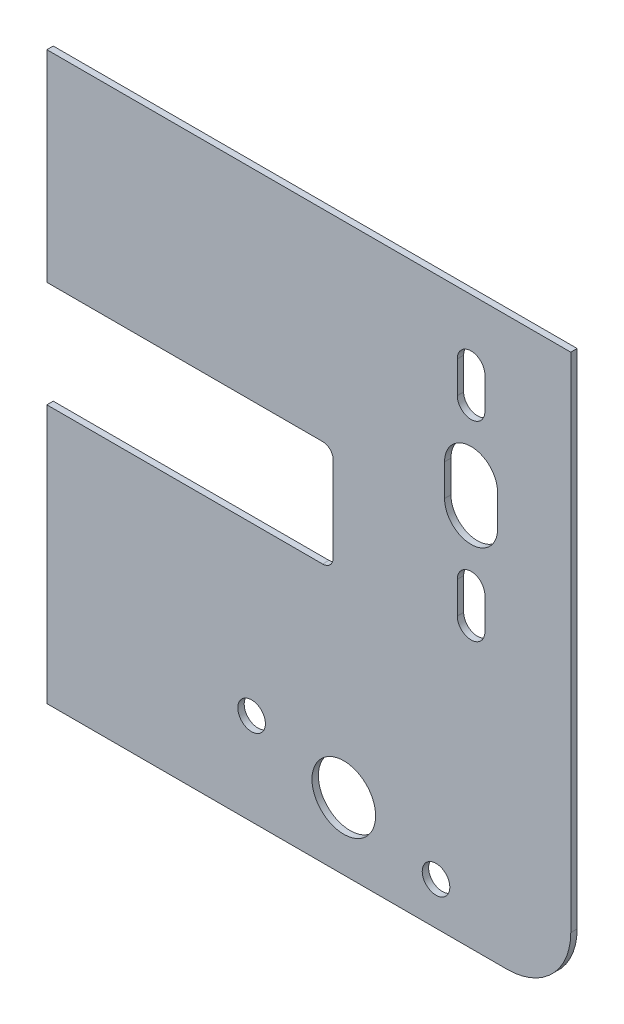
ISO-10303-21;
HEADER;
FILE_DESCRIPTION(('STEP AP214'),'2;1');
FILE_NAME('part.step','',(''),(''),'','','');
FILE_SCHEMA(('AUTOMOTIVE_DESIGN { 1 0 10303 214 1 1 1 1 }'));
ENDSEC;
DATA;
#1=APPLICATION_CONTEXT('core data for automotive mechanical design processes');
#2=APPLICATION_PROTOCOL_DEFINITION('international standard','automotive_design',2000,#1);
#3=PRODUCT_CONTEXT('',#1,'mechanical');
#4=PRODUCT('Part','Part','',(#3));
#5=PRODUCT_RELATED_PRODUCT_CATEGORY('part','',(#4));
#6=PRODUCT_DEFINITION_FORMATION('','',#4);
#7=PRODUCT_DEFINITION_CONTEXT('part definition',#1,'design');
#8=PRODUCT_DEFINITION('design','',#6,#7);
#9=PRODUCT_DEFINITION_SHAPE('','',#8);
#10=(LENGTH_UNIT() NAMED_UNIT(*) SI_UNIT(.MILLI.,.METRE.));
#11=(NAMED_UNIT(*) PLANE_ANGLE_UNIT() SI_UNIT($,.RADIAN.));
#12=(NAMED_UNIT(*) SI_UNIT($,.STERADIAN.) SOLID_ANGLE_UNIT());
#13=UNCERTAINTY_MEASURE_WITH_UNIT(LENGTH_MEASURE(1.E-05),#10,'distance_accuracy_value','');
#14=(GEOMETRIC_REPRESENTATION_CONTEXT(3) GLOBAL_UNCERTAINTY_ASSIGNED_CONTEXT((#13)) GLOBAL_UNIT_ASSIGNED_CONTEXT((#10,
#11,#12)) REPRESENTATION_CONTEXT('',''));
#15=CARTESIAN_POINT('',(0.,0.,0.));
#16=DIRECTION('',(0.,0.,1.));
#17=DIRECTION('',(1.,0.,0.));
#18=AXIS2_PLACEMENT_3D('',#15,#16,#17);
#19=CARTESIAN_POINT('',(-123.5,-133.5,3.));
#20=DIRECTION('',(1.,0.,0.));
#21=DIRECTION('',(0.,0.,-1.));
#22=AXIS2_PLACEMENT_3D('',#19,#20,#21);
#23=PLANE('',#22);
#24=DIRECTION('',(0.,-1.,0.));
#25=VECTOR('',#24,1.);
#26=CARTESIAN_POINT('',(-123.5,-133.5,3.));
#27=LINE('',#26,#25);
#28=CARTESIAN_POINT('',(-123.5,-11.4999999999914,3.));
#29=VERTEX_POINT('',#28);
#30=CARTESIAN_POINT('',(-123.5,-133.5,3.));
#31=VERTEX_POINT('',#30);
#32=EDGE_CURVE('E327',#29,#31,#27,.T.);
#33=ORIENTED_EDGE('',*,*,#32,.F.);
#34=DIRECTION('',(0.,0.,-1.));
#35=VECTOR('',#34,1.);
#36=CARTESIAN_POINT('',(-123.5,-11.4999999999914,3.));
#37=LINE('',#36,#35);
#38=CARTESIAN_POINT('',(-123.5,-11.4999999999914,0.));
#39=VERTEX_POINT('',#38);
#40=EDGE_CURVE('E355',#29,#39,#37,.T.);
#41=ORIENTED_EDGE('',*,*,#40,.T.);
#42=DIRECTION('',(0.,-1.,0.));
#43=VECTOR('',#42,1.);
#44=CARTESIAN_POINT('',(-123.5,-133.5,0.));
#45=LINE('',#44,#43);
#46=CARTESIAN_POINT('',(-123.5,-133.5,0.));
#47=VERTEX_POINT('',#46);
#48=EDGE_CURVE('E338',#39,#47,#45,.T.);
#49=ORIENTED_EDGE('',*,*,#48,.T.);
#50=DIRECTION('',(0.,0.,-1.));
#51=VECTOR('',#50,1.);
#52=CARTESIAN_POINT('',(-123.5,-133.5,3.));
#53=LINE('',#52,#51);
#54=EDGE_CURVE('E334',#31,#47,#53,.T.);
#55=ORIENTED_EDGE('',*,*,#54,.F.);
#56=EDGE_LOOP('',(#33,#41,#49,#55));
#57=FACE_BOUND('',#56,.T.);
#58=ADVANCED_FACE('F33',(#57),#23,.F.);
#59=CARTESIAN_POINT('',(0.,0.,3.));
#60=DIRECTION('',(0.,0.,-1.));
#61=DIRECTION('',(-1.,0.,0.));
#62=AXIS2_PLACEMENT_3D('',#59,#60,#61);
#63=PLANE('',#62);
#64=CARTESIAN_POINT('',(59.9666621830082,-113.5,3.));
#65=DIRECTION('',(0.,0.,-1.));
#66=DIRECTION('',(-1.,0.,0.));
#67=AXIS2_PLACEMENT_3D('',#64,#65,#66);
#68=CIRCLE('',#67,6.50000000000002);
#69=CARTESIAN_POINT('',(53.4666621830082,-113.5,3.));
#70=VERTEX_POINT('',#69);
#71=EDGE_CURVE('E304',#70,#70,#68,.T.);
#72=ORIENTED_EDGE('',*,*,#71,.T.);
#73=EDGE_LOOP('',(#72));
#74=FACE_BOUND('',#73,.T.);
#75=CARTESIAN_POINT('',(16.5000000000001,-101.853142970387,3.));
#76=DIRECTION('',(0.,0.,-1.));
#77=DIRECTION('',(-1.,0.,0.));
#78=AXIS2_PLACEMENT_3D('',#75,#76,#77);
#79=CIRCLE('',#78,15.);
#80=CARTESIAN_POINT('',(1.50000000000009,-101.853142970387,3.));
#81=VERTEX_POINT('',#80);
#82=EDGE_CURVE('E311',#81,#81,#79,.T.);
#83=ORIENTED_EDGE('',*,*,#82,.T.);
#84=EDGE_LOOP('',(#83));
#85=FACE_BOUND('',#84,.T.);
#86=CARTESIAN_POINT('',(-26.9666621830081,-90.2062859407737,3.));
#87=DIRECTION('',(0.,0.,-1.));
#88=DIRECTION('',(-1.,0.,0.));
#89=AXIS2_PLACEMENT_3D('',#86,#87,#88);
#90=CIRCLE('',#89,6.50000000000003);
#91=CARTESIAN_POINT('',(-33.4666621830081,-90.2062859407737,3.));
#92=VERTEX_POINT('',#91);
#93=EDGE_CURVE('E317',#92,#92,#90,.T.);
#94=ORIENTED_EDGE('',*,*,#93,.T.);
#95=EDGE_LOOP('',(#94));
#96=FACE_BOUND('',#95,.T.);
#97=DIRECTION('',(1.,0.,0.));
#98=VECTOR('',#97,1.);
#99=CARTESIAN_POINT('',(-123.5,-133.5,3.));
#100=LINE('',#99,#98);
#101=CARTESIAN_POINT('',(93.5000000000001,-133.5,3.));
#102=VERTEX_POINT('',#101);
#103=EDGE_CURVE('E331',#31,#102,#100,.T.);
#104=ORIENTED_EDGE('',*,*,#103,.T.);
#105=CARTESIAN_POINT('',(93.5000000000001,-103.5,3.));
#106=DIRECTION('',(0.,0.,-1.));
#107=DIRECTION('',(-1.,0.,0.));
#108=AXIS2_PLACEMENT_3D('',#105,#106,#107);
#109=CIRCLE('',#108,30.);
#110=CARTESIAN_POINT('',(123.5,-103.5,3.));
#111=VERTEX_POINT('',#110);
#112=EDGE_CURVE('E11',#102,#111,#109,.F.);
#113=ORIENTED_EDGE('',*,*,#112,.T.);
#114=DIRECTION('',(0.,1.,0.));
#115=VECTOR('',#114,1.);
#116=CARTESIAN_POINT('',(123.5,-133.5,3.));
#117=LINE('',#116,#115);
#118=CARTESIAN_POINT('',(123.5,133.5,3.));
#119=VERTEX_POINT('',#118);
#120=EDGE_CURVE('E322',#111,#119,#117,.T.);
#121=ORIENTED_EDGE('',*,*,#120,.T.);
#122=DIRECTION('',(-1.,0.,0.));
#123=VECTOR('',#122,1.);
#124=CARTESIAN_POINT('',(-123.5,133.5,3.));
#125=LINE('',#124,#123);
#126=CARTESIAN_POINT('',(-123.5,133.5,3.));
#127=VERTEX_POINT('',#126);
#128=EDGE_CURVE('E324',#119,#127,#125,.T.);
#129=ORIENTED_EDGE('',*,*,#128,.T.);
#130=CARTESIAN_POINT('',(-123.5,38.5000000000086,3.));
#131=VERTEX_POINT('',#130);
#132=EDGE_CURVE('E328',#127,#131,#27,.T.);
#133=ORIENTED_EDGE('',*,*,#132,.T.);
#134=DIRECTION('',(1.,0.,0.));
#135=VECTOR('',#134,1.);
#136=CARTESIAN_POINT('',(0.,38.5000000000085,3.));
#137=LINE('',#136,#135);
#138=CARTESIAN_POINT('',(6.50000000000007,38.5000000000085,3.));
#139=VERTEX_POINT('',#138);
#140=EDGE_CURVE('E295',#131,#139,#137,.T.);
#141=ORIENTED_EDGE('',*,*,#140,.T.);
#142=CARTESIAN_POINT('',(6.50000000000007,33.5000000000085,3.));
#143=DIRECTION('',(0.,0.,-1.));
#144=DIRECTION('',(-1.,0.,0.));
#145=AXIS2_PLACEMENT_3D('',#142,#143,#144);
#146=CIRCLE('',#145,5.);
#147=CARTESIAN_POINT('',(11.5000000000001,33.5000000000085,3.));
#148=VERTEX_POINT('',#147);
#149=EDGE_CURVE('E374',#139,#148,#146,.T.);
#150=ORIENTED_EDGE('',*,*,#149,.T.);
#151=DIRECTION('',(0.,-1.,0.));
#152=VECTOR('',#151,1.);
#153=CARTESIAN_POINT('',(11.5000000000001,0.,3.));
#154=LINE('',#153,#152);
#155=CARTESIAN_POINT('',(11.5000000000001,-6.49999999999145,3.));
#156=VERTEX_POINT('',#155);
#157=EDGE_CURVE('E300',#148,#156,#154,.T.);
#158=ORIENTED_EDGE('',*,*,#157,.T.);
#159=CARTESIAN_POINT('',(6.50000000000006,-6.49999999999145,3.));
#160=DIRECTION('',(0.,0.,-1.));
#161=DIRECTION('',(-1.,0.,0.));
#162=AXIS2_PLACEMENT_3D('',#159,#160,#161);
#163=CIRCLE('',#162,5.);
#164=CARTESIAN_POINT('',(6.50000000000006,-11.4999999999915,3.));
#165=VERTEX_POINT('',#164);
#166=EDGE_CURVE('E370',#156,#165,#163,.T.);
#167=ORIENTED_EDGE('',*,*,#166,.T.);
#168=DIRECTION('',(-1.,0.,0.));
#169=VECTOR('',#168,1.);
#170=CARTESIAN_POINT('',(0.,-11.4999999999915,3.));
#171=LINE('',#170,#169);
#172=EDGE_CURVE('E298',#165,#29,#171,.T.);
#173=ORIENTED_EDGE('',*,*,#172,.T.);
#174=ORIENTED_EDGE('',*,*,#32,.T.);
#175=EDGE_LOOP('',(#104,#113,#121,#129,#133,#141,#150,#158,#167,#173,#174));
#176=FACE_BOUND('',#175,.T.);
#177=DIRECTION('',(0.,-1.,0.));
#178=VECTOR('',#177,1.);
#179=CARTESIAN_POINT('',(89.0000000000001,0.,3.));
#180=LINE('',#179,#178);
#181=CARTESIAN_POINT('',(89.0000000000001,59.,3.));
#182=VERTEX_POINT('',#181);
#183=CARTESIAN_POINT('',(89.0000000000001,44.,3.));
#184=VERTEX_POINT('',#183);
#185=EDGE_CURVE('E271',#182,#184,#180,.T.);
#186=ORIENTED_EDGE('',*,*,#185,.T.);
#187=CARTESIAN_POINT('',(76.5000000000001,44.,3.));
#188=DIRECTION('',(0.,0.,-1.));
#189=DIRECTION('',(-1.,0.,0.));
#190=AXIS2_PLACEMENT_3D('',#187,#188,#189);
#191=CIRCLE('',#190,12.5);
#192=CARTESIAN_POINT('',(64.0000000000001,44.,3.));
#193=VERTEX_POINT('',#192);
#194=EDGE_CURVE('E276',#184,#193,#191,.T.);
#195=ORIENTED_EDGE('',*,*,#194,.T.);
#196=DIRECTION('',(0.,1.,0.));
#197=VECTOR('',#196,1.);
#198=CARTESIAN_POINT('',(64.0000000000001,0.,3.));
#199=LINE('',#198,#197);
#200=CARTESIAN_POINT('',(64.0000000000001,59.,3.));
#201=VERTEX_POINT('',#200);
#202=EDGE_CURVE('E269',#193,#201,#199,.T.);
#203=ORIENTED_EDGE('',*,*,#202,.T.);
#204=CARTESIAN_POINT('',(76.5000000000001,59.,3.));
#205=DIRECTION('',(0.,0.,-1.));
#206=DIRECTION('',(-1.,0.,0.));
#207=AXIS2_PLACEMENT_3D('',#204,#205,#206);
#208=CIRCLE('',#207,12.5);
#209=EDGE_CURVE('E273',#201,#182,#208,.T.);
#210=ORIENTED_EDGE('',*,*,#209,.T.);
#211=EDGE_LOOP('',(#186,#195,#203,#210));
#212=FACE_BOUND('',#211,.T.);
#213=DIRECTION('',(0.,-1.,0.));
#214=VECTOR('',#213,1.);
#215=CARTESIAN_POINT('',(83.0000000000001,0.,3.));
#216=LINE('',#215,#214);
#217=CARTESIAN_POINT('',(83.0000000000001,104.,3.));
#218=VERTEX_POINT('',#217);
#219=CARTESIAN_POINT('',(83.0000000000001,89.,3.));
#220=VERTEX_POINT('',#219);
#221=EDGE_CURVE('E267',#218,#220,#216,.T.);
#222=ORIENTED_EDGE('',*,*,#221,.T.);
#223=CARTESIAN_POINT('',(76.5000000000001,89.,3.));
#224=DIRECTION('',(0.,0.,-1.));
#225=DIRECTION('',(-1.,0.,0.));
#226=AXIS2_PLACEMENT_3D('',#223,#224,#225);
#227=CIRCLE('',#226,6.50000000000001);
#228=CARTESIAN_POINT('',(70.0000000000001,89.,3.));
#229=VERTEX_POINT('',#228);
#230=EDGE_CURVE('E285',#220,#229,#227,.T.);
#231=ORIENTED_EDGE('',*,*,#230,.T.);
#232=DIRECTION('',(0.,1.,0.));
#233=VECTOR('',#232,1.);
#234=CARTESIAN_POINT('',(70.0000000000001,0.,3.));
#235=LINE('',#234,#233);
#236=CARTESIAN_POINT('',(70.0000000000001,104.,3.));
#237=VERTEX_POINT('',#236);
#238=EDGE_CURVE('E48',#229,#237,#235,.T.);
#239=ORIENTED_EDGE('',*,*,#238,.T.);
#240=CARTESIAN_POINT('',(76.5000000000001,104.,3.));
#241=DIRECTION('',(0.,0.,-1.));
#242=DIRECTION('',(-1.,0.,0.));
#243=AXIS2_PLACEMENT_3D('',#240,#241,#242);
#244=CIRCLE('',#243,6.50000000000001);
#245=EDGE_CURVE('E283',#237,#218,#244,.T.);
#246=ORIENTED_EDGE('',*,*,#245,.T.);
#247=EDGE_LOOP('',(#222,#231,#239,#246));
#248=FACE_BOUND('',#247,.T.);
#249=DIRECTION('',(0.,-1.,0.));
#250=VECTOR('',#249,1.);
#251=CARTESIAN_POINT('',(83.0000000000001,0.,3.));
#252=LINE('',#251,#250);
#253=CARTESIAN_POINT('',(83.0000000000001,14.,3.));
#254=VERTEX_POINT('',#253);
#255=CARTESIAN_POINT('',(83.0000000000001,-0.999999999999966,3.));
#256=VERTEX_POINT('',#255);
#257=EDGE_CURVE('E264',#254,#256,#252,.T.);
#258=ORIENTED_EDGE('',*,*,#257,.T.);
#259=CARTESIAN_POINT('',(76.5000000000001,-0.999999999999966,3.));
#260=DIRECTION('',(0.,0.,-1.));
#261=DIRECTION('',(-1.,0.,0.));
#262=AXIS2_PLACEMENT_3D('',#259,#260,#261);
#263=CIRCLE('',#262,6.50000000000001);
#264=CARTESIAN_POINT('',(70.0000000000001,-0.999999999999966,3.));
#265=VERTEX_POINT('',#264);
#266=EDGE_CURVE('E281',#256,#265,#263,.T.);
#267=ORIENTED_EDGE('',*,*,#266,.T.);
#268=DIRECTION('',(0.,1.,0.));
#269=VECTOR('',#268,1.);
#270=CARTESIAN_POINT('',(70.0000000000001,0.,3.));
#271=LINE('',#270,#269);
#272=CARTESIAN_POINT('',(70.0000000000001,14.,3.));
#273=VERTEX_POINT('',#272);
#274=EDGE_CURVE('E56',#265,#273,#271,.T.);
#275=ORIENTED_EDGE('',*,*,#274,.T.);
#276=CARTESIAN_POINT('',(76.5000000000001,14.,3.));
#277=DIRECTION('',(0.,0.,-1.));
#278=DIRECTION('',(-1.,0.,0.));
#279=AXIS2_PLACEMENT_3D('',#276,#277,#278);
#280=CIRCLE('',#279,6.50000000000001);
#281=EDGE_CURVE('E279',#273,#254,#280,.T.);
#282=ORIENTED_EDGE('',*,*,#281,.T.);
#283=EDGE_LOOP('',(#258,#267,#275,#282));
#284=FACE_BOUND('',#283,.T.);
#285=ADVANCED_FACE('F388',(#74,#85,#96,#176,#212,#248,#284),#63,.F.);
#286=CARTESIAN_POINT('',(0.,0.,0.));
#287=DIRECTION('',(0.,0.,-1.));
#288=DIRECTION('',(-1.,0.,0.));
#289=AXIS2_PLACEMENT_3D('',#286,#287,#288);
#290=PLANE('',#289);
#291=CARTESIAN_POINT('',(76.5000000000001,89.,0.));
#292=DIRECTION('',(0.,0.,-1.));
#293=DIRECTION('',(-1.,0.,0.));
#294=AXIS2_PLACEMENT_3D('',#291,#292,#293);
#295=CIRCLE('',#294,6.50000000000001);
#296=CARTESIAN_POINT('',(83.0000000000001,89.,0.));
#297=VERTEX_POINT('',#296);
#298=CARTESIAN_POINT('',(70.0000000000001,89.,0.));
#299=VERTEX_POINT('',#298);
#300=EDGE_CURVE('E196',#297,#299,#295,.T.);
#301=ORIENTED_EDGE('',*,*,#300,.F.);
#302=DIRECTION('',(0.,-1.,0.));
#303=VECTOR('',#302,1.);
#304=CARTESIAN_POINT('',(83.0000000000001,89.,0.));
#305=LINE('',#304,#303);
#306=CARTESIAN_POINT('',(83.0000000000001,104.,0.));
#307=VERTEX_POINT('',#306);
#308=EDGE_CURVE('E207',#307,#297,#305,.T.);
#309=ORIENTED_EDGE('',*,*,#308,.F.);
#310=CARTESIAN_POINT('',(76.5000000000001,104.,0.));
#311=DIRECTION('',(0.,0.,-1.));
#312=DIRECTION('',(-1.,0.,0.));
#313=AXIS2_PLACEMENT_3D('',#310,#311,#312);
#314=CIRCLE('',#313,6.50000000000001);
#315=CARTESIAN_POINT('',(70.0000000000001,104.,0.));
#316=VERTEX_POINT('',#315);
#317=EDGE_CURVE('E198',#316,#307,#314,.T.);
#318=ORIENTED_EDGE('',*,*,#317,.F.);
#319=DIRECTION('',(0.,1.,0.));
#320=VECTOR('',#319,1.);
#321=CARTESIAN_POINT('',(70.0000000000001,89.,0.));
#322=LINE('',#321,#320);
#323=EDGE_CURVE('E190',#299,#316,#322,.T.);
#324=ORIENTED_EDGE('',*,*,#323,.F.);
#325=EDGE_LOOP('',(#301,#309,#318,#324));
#326=FACE_BOUND('',#325,.T.);
#327=CARTESIAN_POINT('',(76.5000000000001,-0.999999999999966,0.));
#328=DIRECTION('',(0.,0.,-1.));
#329=DIRECTION('',(-1.,0.,0.));
#330=AXIS2_PLACEMENT_3D('',#327,#328,#329);
#331=CIRCLE('',#330,6.50000000000001);
#332=CARTESIAN_POINT('',(83.0000000000001,-0.999999999999966,0.));
#333=VERTEX_POINT('',#332);
#334=CARTESIAN_POINT('',(70.0000000000001,-0.999999999999966,0.));
#335=VERTEX_POINT('',#334);
#336=EDGE_CURVE('E225',#333,#335,#331,.T.);
#337=ORIENTED_EDGE('',*,*,#336,.F.);
#338=DIRECTION('',(0.,-1.,0.));
#339=VECTOR('',#338,1.);
#340=CARTESIAN_POINT('',(83.0000000000001,-0.999999999999966,0.));
#341=LINE('',#340,#339);
#342=CARTESIAN_POINT('',(83.0000000000001,14.,0.));
#343=VERTEX_POINT('',#342);
#344=EDGE_CURVE('E235',#343,#333,#341,.T.);
#345=ORIENTED_EDGE('',*,*,#344,.F.);
#346=CARTESIAN_POINT('',(76.5000000000001,14.,0.));
#347=DIRECTION('',(0.,0.,-1.));
#348=DIRECTION('',(-1.,0.,0.));
#349=AXIS2_PLACEMENT_3D('',#346,#347,#348);
#350=CIRCLE('',#349,6.50000000000001);
#351=CARTESIAN_POINT('',(70.0000000000001,14.,0.));
#352=VERTEX_POINT('',#351);
#353=EDGE_CURVE('E232',#352,#343,#350,.T.);
#354=ORIENTED_EDGE('',*,*,#353,.F.);
#355=DIRECTION('',(0.,1.,0.));
#356=VECTOR('',#355,1.);
#357=CARTESIAN_POINT('',(70.0000000000001,-0.999999999999966,0.));
#358=LINE('',#357,#356);
#359=EDGE_CURVE('E228',#335,#352,#358,.T.);
#360=ORIENTED_EDGE('',*,*,#359,.F.);
#361=EDGE_LOOP('',(#337,#345,#354,#360));
#362=FACE_BOUND('',#361,.T.);
#363=CARTESIAN_POINT('',(76.5000000000001,44.,0.));
#364=DIRECTION('',(0.,0.,-1.));
#365=DIRECTION('',(-1.,0.,0.));
#366=AXIS2_PLACEMENT_3D('',#363,#364,#365);
#367=CIRCLE('',#366,12.5);
#368=CARTESIAN_POINT('',(89.0000000000001,44.,0.));
#369=VERTEX_POINT('',#368);
#370=CARTESIAN_POINT('',(64.0000000000001,44.,0.));
#371=VERTEX_POINT('',#370);
#372=EDGE_CURVE('E243',#369,#371,#367,.T.);
#373=ORIENTED_EDGE('',*,*,#372,.F.);
#374=DIRECTION('',(0.,-1.,0.));
#375=VECTOR('',#374,1.);
#376=CARTESIAN_POINT('',(89.0000000000001,44.,0.));
#377=LINE('',#376,#375);
#378=CARTESIAN_POINT('',(89.0000000000001,59.,0.));
#379=VERTEX_POINT('',#378);
#380=EDGE_CURVE('E252',#379,#369,#377,.T.);
#381=ORIENTED_EDGE('',*,*,#380,.F.);
#382=CARTESIAN_POINT('',(76.5000000000001,59.,0.));
#383=DIRECTION('',(0.,0.,-1.));
#384=DIRECTION('',(-1.,0.,0.));
#385=AXIS2_PLACEMENT_3D('',#382,#383,#384);
#386=CIRCLE('',#385,12.5);
#387=CARTESIAN_POINT('',(64.0000000000001,59.,0.));
#388=VERTEX_POINT('',#387);
#389=EDGE_CURVE('E249',#388,#379,#386,.T.);
#390=ORIENTED_EDGE('',*,*,#389,.F.);
#391=DIRECTION('',(0.,1.,0.));
#392=VECTOR('',#391,1.);
#393=CARTESIAN_POINT('',(64.0000000000001,44.,0.));
#394=LINE('',#393,#392);
#395=EDGE_CURVE('E246',#371,#388,#394,.T.);
#396=ORIENTED_EDGE('',*,*,#395,.F.);
#397=EDGE_LOOP('',(#373,#381,#390,#396));
#398=FACE_BOUND('',#397,.T.);
#399=DIRECTION('',(0.,1.,0.));
#400=VECTOR('',#399,1.);
#401=CARTESIAN_POINT('',(123.5,-133.5,0.));
#402=LINE('',#401,#400);
#403=CARTESIAN_POINT('',(123.5,-103.5,0.));
#404=VERTEX_POINT('',#403);
#405=CARTESIAN_POINT('',(123.5,133.5,0.));
#406=VERTEX_POINT('',#405);
#407=EDGE_CURVE('E307',#404,#406,#402,.T.);
#408=ORIENTED_EDGE('',*,*,#407,.F.);
#409=CARTESIAN_POINT('',(93.5000000000001,-103.5,0.));
#410=DIRECTION('',(0.,0.,-1.));
#411=DIRECTION('',(-1.,0.,0.));
#412=AXIS2_PLACEMENT_3D('',#409,#410,#411);
#413=CIRCLE('',#412,30.);
#414=CARTESIAN_POINT('',(93.5000000000001,-133.5,0.));
#415=VERTEX_POINT('',#414);
#416=EDGE_CURVE('E379',#404,#415,#413,.T.);
#417=ORIENTED_EDGE('',*,*,#416,.T.);
#418=DIRECTION('',(1.,0.,0.));
#419=VECTOR('',#418,1.);
#420=CARTESIAN_POINT('',(-123.5,-133.5,0.));
#421=LINE('',#420,#419);
#422=EDGE_CURVE('E325',#47,#415,#421,.T.);
#423=ORIENTED_EDGE('',*,*,#422,.F.);
#424=ORIENTED_EDGE('',*,*,#48,.F.);
#425=DIRECTION('',(-1.,0.,0.));
#426=VECTOR('',#425,1.);
#427=CARTESIAN_POINT('',(-123.5,-11.4999999999914,0.));
#428=LINE('',#427,#426);
#429=CARTESIAN_POINT('',(6.50000000000006,-11.4999999999915,0.));
#430=VERTEX_POINT('',#429);
#431=EDGE_CURVE('E293',#430,#39,#428,.T.);
#432=ORIENTED_EDGE('',*,*,#431,.F.);
#433=CARTESIAN_POINT('',(6.50000000000006,-6.49999999999145,0.));
#434=DIRECTION('',(0.,0.,-1.));
#435=DIRECTION('',(-1.,0.,0.));
#436=AXIS2_PLACEMENT_3D('',#433,#434,#435);
#437=CIRCLE('',#436,5.);
#438=CARTESIAN_POINT('',(11.5000000000001,-6.49999999999145,0.));
#439=VERTEX_POINT('',#438);
#440=EDGE_CURVE('E368',#430,#439,#437,.F.);
#441=ORIENTED_EDGE('',*,*,#440,.T.);
#442=DIRECTION('',(0.,-1.,0.));
#443=VECTOR('',#442,1.);
#444=CARTESIAN_POINT('',(11.5000000000001,-11.4999999999915,0.));
#445=LINE('',#444,#443);
#446=CARTESIAN_POINT('',(11.5000000000001,33.5000000000085,0.));
#447=VERTEX_POINT('',#446);
#448=EDGE_CURVE('E290',#447,#439,#445,.T.);
#449=ORIENTED_EDGE('',*,*,#448,.F.);
#450=CARTESIAN_POINT('',(6.50000000000007,33.5000000000085,0.));
#451=DIRECTION('',(0.,0.,-1.));
#452=DIRECTION('',(-1.,0.,0.));
#453=AXIS2_PLACEMENT_3D('',#450,#451,#452);
#454=CIRCLE('',#453,5.);
#455=CARTESIAN_POINT('',(6.50000000000006,38.5000000000085,0.));
#456=VERTEX_POINT('',#455);
#457=EDGE_CURVE('E372',#447,#456,#454,.F.);
#458=ORIENTED_EDGE('',*,*,#457,.T.);
#459=DIRECTION('',(1.,0.,0.));
#460=VECTOR('',#459,1.);
#461=CARTESIAN_POINT('',(-123.5,38.5000000000086,0.));
#462=LINE('',#461,#460);
#463=CARTESIAN_POINT('',(-123.5,38.5000000000086,0.));
#464=VERTEX_POINT('',#463);
#465=EDGE_CURVE('E287',#464,#456,#462,.T.);
#466=ORIENTED_EDGE('',*,*,#465,.F.);
#467=CARTESIAN_POINT('',(-123.5,133.5,0.));
#468=VERTEX_POINT('',#467);
#469=EDGE_CURVE('E339',#468,#464,#45,.T.);
#470=ORIENTED_EDGE('',*,*,#469,.F.);
#471=DIRECTION('',(-1.,0.,0.));
#472=VECTOR('',#471,1.);
#473=CARTESIAN_POINT('',(-123.5,133.5,0.));
#474=LINE('',#473,#472);
#475=EDGE_CURVE('E336',#406,#468,#474,.T.);
#476=ORIENTED_EDGE('',*,*,#475,.F.);
#477=EDGE_LOOP('',(#408,#417,#423,#424,#432,#441,#449,#458,#466,#470,#476));
#478=FACE_BOUND('',#477,.T.);
#479=CARTESIAN_POINT('',(59.9666621830082,-113.5,0.));
#480=DIRECTION('',(0.,0.,-1.));
#481=DIRECTION('',(-1.,0.,0.));
#482=AXIS2_PLACEMENT_3D('',#479,#480,#481);
#483=CIRCLE('',#482,6.50000000000002);
#484=CARTESIAN_POINT('',(53.4666621830082,-113.5,0.));
#485=VERTEX_POINT('',#484);
#486=EDGE_CURVE('E308',#485,#485,#483,.T.);
#487=ORIENTED_EDGE('',*,*,#486,.F.);
#488=EDGE_LOOP('',(#487));
#489=FACE_BOUND('',#488,.T.);
#490=CARTESIAN_POINT('',(16.5000000000001,-101.853142970387,0.));
#491=DIRECTION('',(0.,0.,-1.));
#492=DIRECTION('',(-1.,0.,0.));
#493=AXIS2_PLACEMENT_3D('',#490,#491,#492);
#494=CIRCLE('',#493,15.);
#495=CARTESIAN_POINT('',(1.50000000000009,-101.853142970387,0.));
#496=VERTEX_POINT('',#495);
#497=EDGE_CURVE('E314',#496,#496,#494,.T.);
#498=ORIENTED_EDGE('',*,*,#497,.F.);
#499=EDGE_LOOP('',(#498));
#500=FACE_BOUND('',#499,.T.);
#501=CARTESIAN_POINT('',(-26.9666621830081,-90.2062859407737,0.));
#502=DIRECTION('',(0.,0.,-1.));
#503=DIRECTION('',(-1.,0.,0.));
#504=AXIS2_PLACEMENT_3D('',#501,#502,#503);
#505=CIRCLE('',#504,6.50000000000003);
#506=CARTESIAN_POINT('',(-33.4666621830081,-90.2062859407737,0.));
#507=VERTEX_POINT('',#506);
#508=EDGE_CURVE('E303',#507,#507,#505,.T.);
#509=ORIENTED_EDGE('',*,*,#508,.F.);
#510=EDGE_LOOP('',(#509));
#511=FACE_BOUND('',#510,.T.);
#512=ADVANCED_FACE('F192',(#326,#362,#398,#478,#489,#500,#511),#290,.T.);
#513=CARTESIAN_POINT('',(123.5,-133.5,3.));
#514=DIRECTION('',(-1.,0.,0.));
#515=DIRECTION('',(0.,0.,1.));
#516=AXIS2_PLACEMENT_3D('',#513,#514,#515);
#517=PLANE('',#516);
#518=ORIENTED_EDGE('',*,*,#120,.F.);
#519=DIRECTION('',(0.,0.,-1.));
#520=VECTOR('',#519,1.);
#521=CARTESIAN_POINT('',(123.5,-103.5,3.));
#522=LINE('',#521,#520);
#523=EDGE_CURVE('E376',#111,#404,#522,.T.);
#524=ORIENTED_EDGE('',*,*,#523,.T.);
#525=ORIENTED_EDGE('',*,*,#407,.T.);
#526=DIRECTION('',(0.,0.,-1.));
#527=VECTOR('',#526,1.);
#528=CARTESIAN_POINT('',(123.5,133.5,3.));
#529=LINE('',#528,#527);
#530=EDGE_CURVE('E349',#119,#406,#529,.T.);
#531=ORIENTED_EDGE('',*,*,#530,.F.);
#532=EDGE_LOOP('',(#518,#524,#525,#531));
#533=FACE_BOUND('',#532,.T.);
#534=ADVANCED_FACE('F396',(#533),#517,.F.);
#535=CARTESIAN_POINT('',(-123.5,133.5,3.));
#536=DIRECTION('',(0.,-1.,0.));
#537=DIRECTION('',(0.,0.,-1.));
#538=AXIS2_PLACEMENT_3D('',#535,#536,#537);
#539=PLANE('',#538);
#540=ORIENTED_EDGE('',*,*,#475,.T.);
#541=DIRECTION('',(0.,0.,-1.));
#542=VECTOR('',#541,1.);
#543=CARTESIAN_POINT('',(-123.5,133.5,3.));
#544=LINE('',#543,#542);
#545=EDGE_CURVE('E346',#127,#468,#544,.T.);
#546=ORIENTED_EDGE('',*,*,#545,.F.);
#547=ORIENTED_EDGE('',*,*,#128,.F.);
#548=ORIENTED_EDGE('',*,*,#530,.T.);
#549=EDGE_LOOP('',(#540,#546,#547,#548));
#550=FACE_BOUND('',#549,.T.);
#551=ADVANCED_FACE('F406',(#550),#539,.F.);
#552=ORIENTED_EDGE('',*,*,#469,.T.);
#553=DIRECTION('',(0.,0.,1.));
#554=VECTOR('',#553,1.);
#555=CARTESIAN_POINT('',(-123.5,38.5000000000086,3.));
#556=LINE('',#555,#554);
#557=EDGE_CURVE('E352',#464,#131,#556,.T.);
#558=ORIENTED_EDGE('',*,*,#557,.T.);
#559=ORIENTED_EDGE('',*,*,#132,.F.);
#560=ORIENTED_EDGE('',*,*,#545,.T.);
#561=EDGE_LOOP('',(#552,#558,#559,#560));
#562=FACE_BOUND('',#561,.T.);
#563=ADVANCED_FACE('F410',(#562),#23,.F.);
#564=CARTESIAN_POINT('',(-123.5,-133.5,3.));
#565=DIRECTION('',(0.,1.,0.));
#566=DIRECTION('',(0.,0.,1.));
#567=AXIS2_PLACEMENT_3D('',#564,#565,#566);
#568=PLANE('',#567);
#569=ORIENTED_EDGE('',*,*,#422,.T.);
#570=DIRECTION('',(0.,0.,-1.));
#571=VECTOR('',#570,1.);
#572=CARTESIAN_POINT('',(93.5000000000001,-133.5,3.));
#573=LINE('',#572,#571);
#574=EDGE_CURVE('E41',#415,#102,#573,.F.);
#575=ORIENTED_EDGE('',*,*,#574,.T.);
#576=ORIENTED_EDGE('',*,*,#103,.F.);
#577=ORIENTED_EDGE('',*,*,#54,.T.);
#578=EDGE_LOOP('',(#569,#575,#576,#577));
#579=FACE_BOUND('',#578,.T.);
#580=ADVANCED_FACE('F383',(#579),#568,.F.);
#581=CARTESIAN_POINT('',(-26.9666621830081,-90.2062859407737,3.));
#582=DIRECTION('',(0.,0.,-1.));
#583=DIRECTION('',(-1.,0.,0.));
#584=AXIS2_PLACEMENT_3D('',#581,#582,#583);
#585=CYLINDRICAL_SURFACE('',#584,6.50000000000003);
#586=ORIENTED_EDGE('',*,*,#93,.F.);
#587=EDGE_LOOP('',(#586));
#588=FACE_BOUND('',#587,.T.);
#589=ORIENTED_EDGE('',*,*,#508,.T.);
#590=EDGE_LOOP('',(#589));
#591=FACE_BOUND('',#590,.T.);
#592=ADVANCED_FACE('F447',(#588,#591),#585,.F.);
#593=CARTESIAN_POINT('',(16.5000000000001,-101.853142970387,3.));
#594=DIRECTION('',(0.,0.,-1.));
#595=DIRECTION('',(-1.,0.,0.));
#596=AXIS2_PLACEMENT_3D('',#593,#594,#595);
#597=CYLINDRICAL_SURFACE('',#596,15.);
#598=ORIENTED_EDGE('',*,*,#82,.F.);
#599=EDGE_LOOP('',(#598));
#600=FACE_BOUND('',#599,.T.);
#601=ORIENTED_EDGE('',*,*,#497,.T.);
#602=EDGE_LOOP('',(#601));
#603=FACE_BOUND('',#602,.T.);
#604=ADVANCED_FACE('F483',(#600,#603),#597,.F.);
#605=CARTESIAN_POINT('',(59.9666621830082,-113.5,3.));
#606=DIRECTION('',(0.,0.,-1.));
#607=DIRECTION('',(-1.,0.,0.));
#608=AXIS2_PLACEMENT_3D('',#605,#606,#607);
#609=CYLINDRICAL_SURFACE('',#608,6.50000000000002);
#610=ORIENTED_EDGE('',*,*,#71,.F.);
#611=EDGE_LOOP('',(#610));
#612=FACE_BOUND('',#611,.T.);
#613=ORIENTED_EDGE('',*,*,#486,.T.);
#614=EDGE_LOOP('',(#613));
#615=FACE_BOUND('',#614,.T.);
#616=ADVANCED_FACE('F478',(#612,#615),#609,.F.);
#617=CARTESIAN_POINT('',(11.5000000000001,-11.4999999999915,10.));
#618=DIRECTION('',(1.,0.,0.));
#619=DIRECTION('',(0.,0.,-1.));
#620=AXIS2_PLACEMENT_3D('',#617,#618,#619);
#621=PLANE('',#620);
#622=ORIENTED_EDGE('',*,*,#448,.T.);
#623=DIRECTION('',(0.,0.,-1.));
#624=VECTOR('',#623,1.);
#625=CARTESIAN_POINT('',(11.5000000000001,-6.49999999999145,3.));
#626=LINE('',#625,#624);
#627=EDGE_CURVE('E364',#439,#156,#626,.F.);
#628=ORIENTED_EDGE('',*,*,#627,.T.);
#629=ORIENTED_EDGE('',*,*,#157,.F.);
#630=DIRECTION('',(0.,0.,-1.));
#631=VECTOR('',#630,1.);
#632=CARTESIAN_POINT('',(11.5000000000001,33.5000000000085,0.));
#633=LINE('',#632,#631);
#634=EDGE_CURVE('E361',#148,#447,#633,.T.);
#635=ORIENTED_EDGE('',*,*,#634,.T.);
#636=EDGE_LOOP('',(#622,#628,#629,#635));
#637=FACE_BOUND('',#636,.T.);
#638=ADVANCED_FACE('F420',(#637),#621,.F.);
#639=CARTESIAN_POINT('',(-123.5,-11.4999999999914,10.));
#640=DIRECTION('',(0.,-1.,0.));
#641=DIRECTION('',(1.,0.,0.));
#642=AXIS2_PLACEMENT_3D('',#639,#640,#641);
#643=PLANE('',#642);
#644=ORIENTED_EDGE('',*,*,#172,.F.);
#645=DIRECTION('',(0.,0.,-1.));
#646=VECTOR('',#645,1.);
#647=CARTESIAN_POINT('',(6.50000000000006,-11.4999999999915,0.));
#648=LINE('',#647,#646);
#649=EDGE_CURVE('E358',#165,#430,#648,.T.);
#650=ORIENTED_EDGE('',*,*,#649,.T.);
#651=ORIENTED_EDGE('',*,*,#431,.T.);
#652=ORIENTED_EDGE('',*,*,#40,.F.);
#653=EDGE_LOOP('',(#644,#650,#651,#652));
#654=FACE_BOUND('',#653,.T.);
#655=ADVANCED_FACE('F429',(#654),#643,.F.);
#656=CARTESIAN_POINT('',(-123.5,38.5000000000086,10.));
#657=DIRECTION('',(0.,1.,0.));
#658=DIRECTION('',(-1.,0.,0.));
#659=AXIS2_PLACEMENT_3D('',#656,#657,#658);
#660=PLANE('',#659);
#661=ORIENTED_EDGE('',*,*,#465,.T.);
#662=DIRECTION('',(0.,0.,-1.));
#663=VECTOR('',#662,1.);
#664=CARTESIAN_POINT('',(6.50000000000007,38.5000000000085,3.));
#665=LINE('',#664,#663);
#666=EDGE_CURVE('E366',#456,#139,#665,.F.);
#667=ORIENTED_EDGE('',*,*,#666,.T.);
#668=ORIENTED_EDGE('',*,*,#140,.F.);
#669=ORIENTED_EDGE('',*,*,#557,.F.);
#670=EDGE_LOOP('',(#661,#667,#668,#669));
#671=FACE_BOUND('',#670,.T.);
#672=ADVANCED_FACE('F412',(#671),#660,.F.);
#673=CARTESIAN_POINT('',(6.50000000000006,-6.49999999999145,10.));
#674=DIRECTION('',(0.,0.,1.));
#675=DIRECTION('',(1.,0.,0.));
#676=AXIS2_PLACEMENT_3D('',#673,#674,#675);
#677=CYLINDRICAL_SURFACE('',#676,5.);
#678=ORIENTED_EDGE('',*,*,#166,.F.);
#679=ORIENTED_EDGE('',*,*,#627,.F.);
#680=ORIENTED_EDGE('',*,*,#440,.F.);
#681=ORIENTED_EDGE('',*,*,#649,.F.);
#682=EDGE_LOOP('',(#678,#679,#680,#681));
#683=FACE_BOUND('',#682,.T.);
#684=ADVANCED_FACE('F426',(#683),#677,.F.);
#685=CARTESIAN_POINT('',(6.50000000000007,33.5000000000085,10.));
#686=DIRECTION('',(0.,0.,1.));
#687=DIRECTION('',(1.,0.,0.));
#688=AXIS2_PLACEMENT_3D('',#685,#686,#687);
#689=CYLINDRICAL_SURFACE('',#688,5.);
#690=ORIENTED_EDGE('',*,*,#149,.F.);
#691=ORIENTED_EDGE('',*,*,#666,.F.);
#692=ORIENTED_EDGE('',*,*,#457,.F.);
#693=ORIENTED_EDGE('',*,*,#634,.F.);
#694=EDGE_LOOP('',(#690,#691,#692,#693));
#695=FACE_BOUND('',#694,.T.);
#696=ADVANCED_FACE('F417',(#695),#689,.F.);
#697=CARTESIAN_POINT('',(93.5000000000001,-103.5,3.));
#698=DIRECTION('',(0.,0.,-1.));
#699=DIRECTION('',(-1.,0.,0.));
#700=AXIS2_PLACEMENT_3D('',#697,#698,#699);
#701=CYLINDRICAL_SURFACE('',#700,30.);
#702=ORIENTED_EDGE('',*,*,#112,.F.);
#703=ORIENTED_EDGE('',*,*,#574,.F.);
#704=ORIENTED_EDGE('',*,*,#416,.F.);
#705=ORIENTED_EDGE('',*,*,#523,.F.);
#706=EDGE_LOOP('',(#702,#703,#704,#705));
#707=FACE_BOUND('',#706,.T.);
#708=ADVANCED_FACE('F35',(#707),#701,.T.);
#709=CARTESIAN_POINT('',(76.5000000000001,44.,10.));
#710=DIRECTION('',(0.,0.,-1.));
#711=DIRECTION('',(-1.,0.,0.));
#712=AXIS2_PLACEMENT_3D('',#709,#710,#711);
#713=CYLINDRICAL_SURFACE('',#712,12.5);
#714=DIRECTION('',(0.,0.,-1.));
#715=VECTOR('',#714,1.);
#716=CARTESIAN_POINT('',(89.0000000000001,44.,10.));
#717=LINE('',#716,#715);
#718=EDGE_CURVE('E229',#184,#369,#717,.T.);
#719=ORIENTED_EDGE('',*,*,#718,.T.);
#720=ORIENTED_EDGE('',*,*,#372,.T.);
#721=DIRECTION('',(0.,0.,-1.));
#722=VECTOR('',#721,1.);
#723=CARTESIAN_POINT('',(64.0000000000001,44.,10.));
#724=LINE('',#723,#722);
#725=EDGE_CURVE('E254',#193,#371,#724,.T.);
#726=ORIENTED_EDGE('',*,*,#725,.F.);
#727=ORIENTED_EDGE('',*,*,#194,.F.);
#728=EDGE_LOOP('',(#719,#720,#726,#727));
#729=FACE_BOUND('',#728,.T.);
#730=ADVANCED_FACE('F458',(#729),#713,.F.);
#731=CARTESIAN_POINT('',(76.5000000000001,59.,10.));
#732=DIRECTION('',(0.,0.,-1.));
#733=DIRECTION('',(-1.,0.,0.));
#734=AXIS2_PLACEMENT_3D('',#731,#732,#733);
#735=CYLINDRICAL_SURFACE('',#734,12.5);
#736=DIRECTION('',(0.,0.,-1.));
#737=VECTOR('',#736,1.);
#738=CARTESIAN_POINT('',(64.0000000000001,59.,10.));
#739=LINE('',#738,#737);
#740=EDGE_CURVE('E259',#201,#388,#739,.T.);
#741=ORIENTED_EDGE('',*,*,#740,.T.);
#742=ORIENTED_EDGE('',*,*,#389,.T.);
#743=DIRECTION('',(0.,0.,-1.));
#744=VECTOR('',#743,1.);
#745=CARTESIAN_POINT('',(89.0000000000001,59.,10.));
#746=LINE('',#745,#744);
#747=EDGE_CURVE('E257',#182,#379,#746,.T.);
#748=ORIENTED_EDGE('',*,*,#747,.F.);
#749=ORIENTED_EDGE('',*,*,#209,.F.);
#750=EDGE_LOOP('',(#741,#742,#748,#749));
#751=FACE_BOUND('',#750,.T.);
#752=ADVANCED_FACE('F462',(#751),#735,.F.);
#753=CARTESIAN_POINT('',(89.0000000000001,44.,10.));
#754=DIRECTION('',(1.,0.,0.));
#755=DIRECTION('',(0.,0.,-1.));
#756=AXIS2_PLACEMENT_3D('',#753,#754,#755);
#757=PLANE('',#756);
#758=ORIENTED_EDGE('',*,*,#747,.T.);
#759=ORIENTED_EDGE('',*,*,#380,.T.);
#760=ORIENTED_EDGE('',*,*,#718,.F.);
#761=ORIENTED_EDGE('',*,*,#185,.F.);
#762=EDGE_LOOP('',(#758,#759,#760,#761));
#763=FACE_BOUND('',#762,.T.);
#764=ADVANCED_FACE('F468',(#763),#757,.F.);
#765=CARTESIAN_POINT('',(64.0000000000001,44.,10.));
#766=DIRECTION('',(-1.,0.,0.));
#767=DIRECTION('',(0.,0.,1.));
#768=AXIS2_PLACEMENT_3D('',#765,#766,#767);
#769=PLANE('',#768);
#770=ORIENTED_EDGE('',*,*,#725,.T.);
#771=ORIENTED_EDGE('',*,*,#395,.T.);
#772=ORIENTED_EDGE('',*,*,#740,.F.);
#773=ORIENTED_EDGE('',*,*,#202,.F.);
#774=EDGE_LOOP('',(#770,#771,#772,#773));
#775=FACE_BOUND('',#774,.T.);
#776=ADVANCED_FACE('F473',(#775),#769,.F.);
#777=CARTESIAN_POINT('',(76.5000000000001,-0.999999999999966,10.));
#778=DIRECTION('',(0.,0.,-1.));
#779=DIRECTION('',(-1.,0.,0.));
#780=AXIS2_PLACEMENT_3D('',#777,#778,#779);
#781=CYLINDRICAL_SURFACE('',#780,6.50000000000001);
#782=DIRECTION('',(0.,0.,-1.));
#783=VECTOR('',#782,1.);
#784=CARTESIAN_POINT('',(83.0000000000001,-0.999999999999966,10.));
#785=LINE('',#784,#783);
#786=EDGE_CURVE('E213',#256,#333,#785,.T.);
#787=ORIENTED_EDGE('',*,*,#786,.T.);
#788=ORIENTED_EDGE('',*,*,#336,.T.);
#789=DIRECTION('',(0.,0.,-1.));
#790=VECTOR('',#789,1.);
#791=CARTESIAN_POINT('',(70.0000000000001,-0.999999999999966,10.));
#792=LINE('',#791,#790);
#793=EDGE_CURVE('E236',#265,#335,#792,.T.);
#794=ORIENTED_EDGE('',*,*,#793,.F.);
#795=ORIENTED_EDGE('',*,*,#266,.F.);
#796=EDGE_LOOP('',(#787,#788,#794,#795));
#797=FACE_BOUND('',#796,.T.);
#798=ADVANCED_FACE('F552',(#797),#781,.F.);
#799=CARTESIAN_POINT('',(76.5000000000001,14.,10.));
#800=DIRECTION('',(0.,0.,-1.));
#801=DIRECTION('',(-1.,0.,0.));
#802=AXIS2_PLACEMENT_3D('',#799,#800,#801);
#803=CYLINDRICAL_SURFACE('',#802,6.50000000000001);
#804=DIRECTION('',(0.,0.,-1.));
#805=VECTOR('',#804,1.);
#806=CARTESIAN_POINT('',(70.0000000000001,14.,10.));
#807=LINE('',#806,#805);
#808=EDGE_CURVE('E239',#273,#352,#807,.T.);
#809=ORIENTED_EDGE('',*,*,#808,.T.);
#810=ORIENTED_EDGE('',*,*,#353,.T.);
#811=DIRECTION('',(0.,0.,-1.));
#812=VECTOR('',#811,1.);
#813=CARTESIAN_POINT('',(83.0000000000001,14.,10.));
#814=LINE('',#813,#812);
#815=EDGE_CURVE('E216',#254,#343,#814,.T.);
#816=ORIENTED_EDGE('',*,*,#815,.F.);
#817=ORIENTED_EDGE('',*,*,#281,.F.);
#818=EDGE_LOOP('',(#809,#810,#816,#817));
#819=FACE_BOUND('',#818,.T.);
#820=ADVANCED_FACE('F560',(#819),#803,.F.);
#821=CARTESIAN_POINT('',(83.0000000000001,-0.999999999999966,10.));
#822=DIRECTION('',(1.,0.,0.));
#823=DIRECTION('',(0.,0.,-1.));
#824=AXIS2_PLACEMENT_3D('',#821,#822,#823);
#825=PLANE('',#824);
#826=ORIENTED_EDGE('',*,*,#815,.T.);
#827=ORIENTED_EDGE('',*,*,#344,.T.);
#828=ORIENTED_EDGE('',*,*,#786,.F.);
#829=ORIENTED_EDGE('',*,*,#257,.F.);
#830=EDGE_LOOP('',(#826,#827,#828,#829));
#831=FACE_BOUND('',#830,.T.);
#832=ADVANCED_FACE('F569',(#831),#825,.F.);
#833=CARTESIAN_POINT('',(70.0000000000001,-0.999999999999966,10.));
#834=DIRECTION('',(-1.,0.,0.));
#835=DIRECTION('',(0.,0.,1.));
#836=AXIS2_PLACEMENT_3D('',#833,#834,#835);
#837=PLANE('',#836);
#838=ORIENTED_EDGE('',*,*,#793,.T.);
#839=ORIENTED_EDGE('',*,*,#359,.T.);
#840=ORIENTED_EDGE('',*,*,#808,.F.);
#841=ORIENTED_EDGE('',*,*,#274,.F.);
#842=EDGE_LOOP('',(#838,#839,#840,#841));
#843=FACE_BOUND('',#842,.T.);
#844=ADVANCED_FACE('F578',(#843),#837,.F.);
#845=CARTESIAN_POINT('',(76.5000000000001,89.,10.));
#846=DIRECTION('',(0.,0.,-1.));
#847=DIRECTION('',(-1.,0.,0.));
#848=AXIS2_PLACEMENT_3D('',#845,#846,#847);
#849=CYLINDRICAL_SURFACE('',#848,6.50000000000001);
#850=DIRECTION('',(0.,0.,-1.));
#851=VECTOR('',#850,1.);
#852=CARTESIAN_POINT('',(83.0000000000001,89.,10.));
#853=LINE('',#852,#851);
#854=EDGE_CURVE('E212',#220,#297,#853,.T.);
#855=ORIENTED_EDGE('',*,*,#854,.T.);
#856=ORIENTED_EDGE('',*,*,#300,.T.);
#857=DIRECTION('',(0.,0.,-1.));
#858=VECTOR('',#857,1.);
#859=CARTESIAN_POINT('',(70.0000000000001,89.,10.));
#860=LINE('',#859,#858);
#861=EDGE_CURVE('E202',#229,#299,#860,.T.);
#862=ORIENTED_EDGE('',*,*,#861,.F.);
#863=ORIENTED_EDGE('',*,*,#230,.F.);
#864=EDGE_LOOP('',(#855,#856,#862,#863));
#865=FACE_BOUND('',#864,.T.);
#866=ADVANCED_FACE('F210',(#865),#849,.F.);
#867=CARTESIAN_POINT('',(76.5000000000001,104.,10.));
#868=DIRECTION('',(0.,0.,-1.));
#869=DIRECTION('',(-1.,0.,0.));
#870=AXIS2_PLACEMENT_3D('',#867,#868,#869);
#871=CYLINDRICAL_SURFACE('',#870,6.50000000000001);
#872=DIRECTION('',(0.,0.,-1.));
#873=VECTOR('',#872,1.);
#874=CARTESIAN_POINT('',(70.0000000000001,104.,10.));
#875=LINE('',#874,#873);
#876=EDGE_CURVE('E206',#237,#316,#875,.T.);
#877=ORIENTED_EDGE('',*,*,#876,.T.);
#878=ORIENTED_EDGE('',*,*,#317,.T.);
#879=DIRECTION('',(0.,0.,-1.));
#880=VECTOR('',#879,1.);
#881=CARTESIAN_POINT('',(83.0000000000001,104.,10.));
#882=LINE('',#881,#880);
#883=EDGE_CURVE('E222',#218,#307,#882,.T.);
#884=ORIENTED_EDGE('',*,*,#883,.F.);
#885=ORIENTED_EDGE('',*,*,#245,.F.);
#886=EDGE_LOOP('',(#877,#878,#884,#885));
#887=FACE_BOUND('',#886,.T.);
#888=ADVANCED_FACE('F595',(#887),#871,.F.);
#889=CARTESIAN_POINT('',(83.0000000000001,89.,10.));
#890=DIRECTION('',(1.,0.,0.));
#891=DIRECTION('',(0.,0.,-1.));
#892=AXIS2_PLACEMENT_3D('',#889,#890,#891);
#893=PLANE('',#892);
#894=ORIENTED_EDGE('',*,*,#883,.T.);
#895=ORIENTED_EDGE('',*,*,#308,.T.);
#896=ORIENTED_EDGE('',*,*,#854,.F.);
#897=ORIENTED_EDGE('',*,*,#221,.F.);
#898=EDGE_LOOP('',(#894,#895,#896,#897));
#899=FACE_BOUND('',#898,.T.);
#900=ADVANCED_FACE('F603',(#899),#893,.F.);
#901=CARTESIAN_POINT('',(70.0000000000001,89.,10.));
#902=DIRECTION('',(-1.,0.,0.));
#903=DIRECTION('',(0.,0.,1.));
#904=AXIS2_PLACEMENT_3D('',#901,#902,#903);
#905=PLANE('',#904);
#906=ORIENTED_EDGE('',*,*,#861,.T.);
#907=ORIENTED_EDGE('',*,*,#323,.T.);
#908=ORIENTED_EDGE('',*,*,#876,.F.);
#909=ORIENTED_EDGE('',*,*,#238,.F.);
#910=EDGE_LOOP('',(#906,#907,#908,#909));
#911=FACE_BOUND('',#910,.T.);
#912=ADVANCED_FACE('F203',(#911),#905,.F.);
#913=CLOSED_SHELL('',(#58,#285,#512,#534,#551,#563,#580,#592,#604,#616,#638,#655,#672,#684,#696,
#708,#730,#752,#764,#776,#798,#820,#832,#844,#866,#888,#900,#912));
#914=MANIFOLD_SOLID_BREP('B2',#913);
#915=ADVANCED_BREP_SHAPE_REPRESENTATION('',(#18,#914),#14);
#916=SHAPE_DEFINITION_REPRESENTATION(#9,#915);
ENDSEC;
END-ISO-10303-21;
